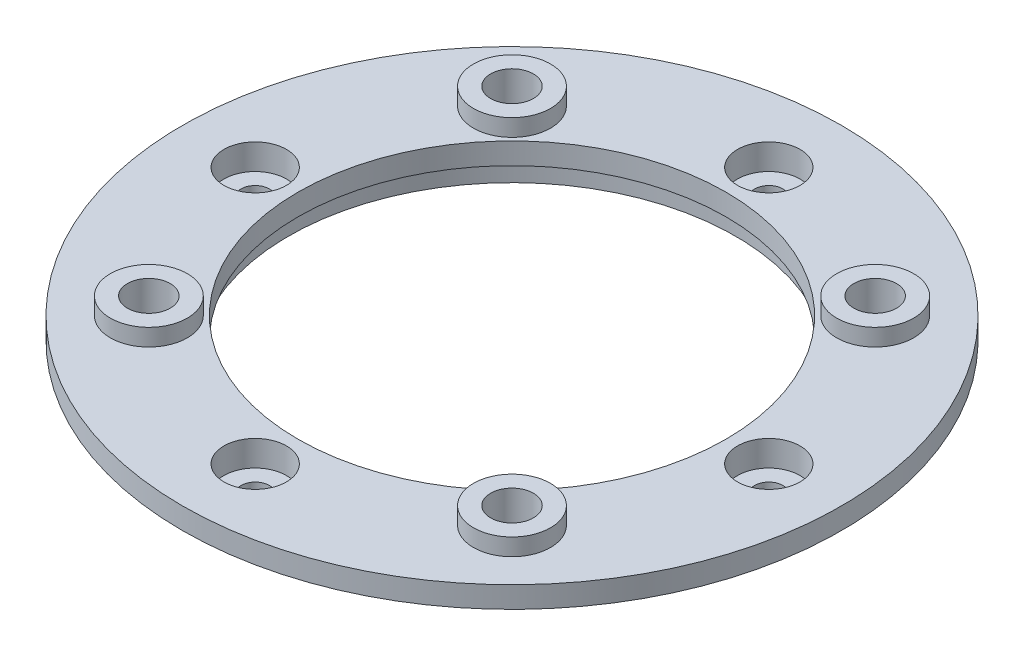
ISO-10303-21;
HEADER;
FILE_DESCRIPTION(('STEP AP214'),'2;1');
FILE_NAME('part.step','',(''),(''),'','','');
FILE_SCHEMA(('AUTOMOTIVE_DESIGN { 1 0 10303 214 1 1 1 1 }'));
ENDSEC;
DATA;
#1=APPLICATION_CONTEXT('core data for automotive mechanical design processes');
#2=APPLICATION_PROTOCOL_DEFINITION('international standard','automotive_design',2000,#1);
#3=PRODUCT_CONTEXT('',#1,'mechanical');
#4=PRODUCT('Part','Part','',(#3));
#5=PRODUCT_RELATED_PRODUCT_CATEGORY('part','',(#4));
#6=PRODUCT_DEFINITION_FORMATION('','',#4);
#7=PRODUCT_DEFINITION_CONTEXT('part definition',#1,'design');
#8=PRODUCT_DEFINITION('design','',#6,#7);
#9=PRODUCT_DEFINITION_SHAPE('','',#8);
#10=(LENGTH_UNIT() NAMED_UNIT(*) SI_UNIT(.MILLI.,.METRE.));
#11=(NAMED_UNIT(*) PLANE_ANGLE_UNIT() SI_UNIT($,.RADIAN.));
#12=(NAMED_UNIT(*) SI_UNIT($,.STERADIAN.) SOLID_ANGLE_UNIT());
#13=UNCERTAINTY_MEASURE_WITH_UNIT(LENGTH_MEASURE(1.E-05),#10,'distance_accuracy_value','');
#14=(GEOMETRIC_REPRESENTATION_CONTEXT(3) GLOBAL_UNCERTAINTY_ASSIGNED_CONTEXT((#13)) GLOBAL_UNIT_ASSIGNED_CONTEXT((#10,
#11,#12)) REPRESENTATION_CONTEXT('',''));
#15=CARTESIAN_POINT('',(0.,0.,0.));
#16=DIRECTION('',(0.,0.,1.));
#17=DIRECTION('',(1.,0.,0.));
#18=AXIS2_PLACEMENT_3D('',#15,#16,#17);
#19=CARTESIAN_POINT('',(0.,5.,0.));
#20=DIRECTION('',(0.,1.,0.));
#21=DIRECTION('',(0.,0.,1.));
#22=AXIS2_PLACEMENT_3D('',#19,#20,#21);
#23=PLANE('',#22);
#24=CARTESIAN_POINT('',(21.2132034355964,5.,21.2132034355965));
#25=DIRECTION('',(0.,1.,0.));
#26=DIRECTION('',(0.,0.,1.));
#27=AXIS2_PLACEMENT_3D('',#24,#25,#26);
#28=CIRCLE('',#27,4.5);
#29=CARTESIAN_POINT('',(21.2132034355964,5.,25.7132034355964));
#30=VERTEX_POINT('',#29);
#31=EDGE_CURVE('E161',#30,#30,#28,.T.);
#32=ORIENTED_EDGE('',*,*,#31,.F.);
#33=EDGE_LOOP('',(#32));
#34=FACE_BOUND('',#33,.T.);
#35=CARTESIAN_POINT('',(-21.2132034355964,5.,-21.2132034355965));
#36=DIRECTION('',(0.,1.,0.));
#37=DIRECTION('',(0.,0.,1.));
#38=AXIS2_PLACEMENT_3D('',#35,#36,#37);
#39=CIRCLE('',#38,4.5);
#40=CARTESIAN_POINT('',(-21.2132034355964,5.,-16.7132034355965));
#41=VERTEX_POINT('',#40);
#42=EDGE_CURVE('E141',#41,#41,#39,.T.);
#43=ORIENTED_EDGE('',*,*,#42,.F.);
#44=EDGE_LOOP('',(#43));
#45=FACE_BOUND('',#44,.T.);
#46=CARTESIAN_POINT('',(0.,5.,30.));
#47=DIRECTION('',(0.,1.,0.));
#48=DIRECTION('',(0.,0.,1.));
#49=AXIS2_PLACEMENT_3D('',#46,#47,#48);
#50=CIRCLE('',#49,3.65);
#51=CARTESIAN_POINT('',(0.,5.,33.65));
#52=VERTEX_POINT('',#51);
#53=EDGE_CURVE('E134',#52,#52,#50,.T.);
#54=ORIENTED_EDGE('',*,*,#53,.F.);
#55=EDGE_LOOP('',(#54));
#56=FACE_BOUND('',#55,.T.);
#57=CARTESIAN_POINT('',(30.,5.,0.));
#58=DIRECTION('',(0.,1.,0.));
#59=DIRECTION('',(0.,0.,1.));
#60=AXIS2_PLACEMENT_3D('',#57,#58,#59);
#61=CIRCLE('',#60,3.65);
#62=CARTESIAN_POINT('',(30.,5.,3.65));
#63=VERTEX_POINT('',#62);
#64=EDGE_CURVE('E129',#63,#63,#61,.T.);
#65=ORIENTED_EDGE('',*,*,#64,.F.);
#66=EDGE_LOOP('',(#65));
#67=FACE_BOUND('',#66,.T.);
#68=CARTESIAN_POINT('',(0.,5.,-30.));
#69=DIRECTION('',(0.,1.,0.));
#70=DIRECTION('',(0.,0.,1.));
#71=AXIS2_PLACEMENT_3D('',#68,#69,#70);
#72=CIRCLE('',#71,3.65);
#73=CARTESIAN_POINT('',(0.,5.,-26.35));
#74=VERTEX_POINT('',#73);
#75=EDGE_CURVE('E120',#74,#74,#72,.T.);
#76=ORIENTED_EDGE('',*,*,#75,.F.);
#77=EDGE_LOOP('',(#76));
#78=FACE_BOUND('',#77,.T.);
#79=CARTESIAN_POINT('',(-30.,5.,0.));
#80=DIRECTION('',(0.,1.,0.));
#81=DIRECTION('',(0.,0.,1.));
#82=AXIS2_PLACEMENT_3D('',#79,#80,#81);
#83=CIRCLE('',#82,3.65);
#84=CARTESIAN_POINT('',(-30.,5.,3.65000000000001));
#85=VERTEX_POINT('',#84);
#86=EDGE_CURVE('E109',#85,#85,#83,.T.);
#87=ORIENTED_EDGE('',*,*,#86,.F.);
#88=EDGE_LOOP('',(#87));
#89=FACE_BOUND('',#88,.T.);
#90=CARTESIAN_POINT('',(0.,5.,0.));
#91=DIRECTION('',(0.,1.,0.));
#92=DIRECTION('',(0.,0.,1.));
#93=AXIS2_PLACEMENT_3D('',#90,#91,#92);
#94=CIRCLE('',#93,38.5);
#95=CARTESIAN_POINT('',(0.,5.,38.5));
#96=VERTEX_POINT('',#95);
#97=EDGE_CURVE('E68',#96,#96,#94,.T.);
#98=ORIENTED_EDGE('',*,*,#97,.T.);
#99=EDGE_LOOP('',(#98));
#100=FACE_BOUND('',#99,.T.);
#101=CARTESIAN_POINT('',(0.,5.,0.));
#102=DIRECTION('',(0.,1.,0.));
#103=DIRECTION('',(0.,0.,1.));
#104=AXIS2_PLACEMENT_3D('',#101,#102,#103);
#105=CIRCLE('',#104,25.);
#106=CARTESIAN_POINT('',(0.,5.,25.));
#107=VERTEX_POINT('',#106);
#108=EDGE_CURVE('E72',#107,#107,#105,.T.);
#109=ORIENTED_EDGE('',*,*,#108,.F.);
#110=EDGE_LOOP('',(#109));
#111=FACE_BOUND('',#110,.T.);
#112=CARTESIAN_POINT('',(21.2132034355965,5.,-21.2132034355964));
#113=DIRECTION('',(0.,1.,0.));
#114=DIRECTION('',(0.,0.,1.));
#115=AXIS2_PLACEMENT_3D('',#112,#113,#114);
#116=CIRCLE('',#115,4.5);
#117=CARTESIAN_POINT('',(21.2132034355965,5.,-16.7132034355964));
#118=VERTEX_POINT('',#117);
#119=EDGE_CURVE('E152',#118,#118,#116,.T.);
#120=ORIENTED_EDGE('',*,*,#119,.F.);
#121=EDGE_LOOP('',(#120));
#122=FACE_BOUND('',#121,.T.);
#123=CARTESIAN_POINT('',(-21.2132034355965,5.,21.2132034355964));
#124=DIRECTION('',(0.,1.,0.));
#125=DIRECTION('',(0.,0.,1.));
#126=AXIS2_PLACEMENT_3D('',#123,#124,#125);
#127=CIRCLE('',#126,4.5);
#128=CARTESIAN_POINT('',(-21.2132034355965,5.,25.7132034355964));
#129=VERTEX_POINT('',#128);
#130=EDGE_CURVE('E170',#129,#129,#127,.T.);
#131=ORIENTED_EDGE('',*,*,#130,.F.);
#132=EDGE_LOOP('',(#131));
#133=FACE_BOUND('',#132,.T.);
#134=ADVANCED_FACE('F41',(#34,#45,#56,#67,#78,#89,#100,#111,#122,#133),#23,.T.);
#135=CARTESIAN_POINT('',(-30.,0.,0.));
#136=DIRECTION('',(0.,1.,0.));
#137=DIRECTION('',(0.,0.,1.));
#138=AXIS2_PLACEMENT_3D('',#135,#136,#137);
#139=CYLINDRICAL_SURFACE('',#138,1.65);
#140=CARTESIAN_POINT('',(-30.,0.,0.));
#141=DIRECTION('',(0.,1.,0.));
#142=DIRECTION('',(0.,0.,1.));
#143=AXIS2_PLACEMENT_3D('',#140,#141,#142);
#144=CIRCLE('',#143,1.65);
#145=CARTESIAN_POINT('',(-30.,0.,1.65));
#146=VERTEX_POINT('',#145);
#147=EDGE_CURVE('E84',#146,#146,#144,.T.);
#148=ORIENTED_EDGE('',*,*,#147,.F.);
#149=EDGE_LOOP('',(#148));
#150=FACE_BOUND('',#149,.T.);
#151=CARTESIAN_POINT('',(-30.,2.,0.));
#152=DIRECTION('',(0.,1.,0.));
#153=DIRECTION('',(0.,0.,1.));
#154=AXIS2_PLACEMENT_3D('',#151,#152,#153);
#155=CIRCLE('',#154,1.65);
#156=CARTESIAN_POINT('',(-30.,2.,1.65));
#157=VERTEX_POINT('',#156);
#158=EDGE_CURVE('E105',#157,#157,#155,.T.);
#159=ORIENTED_EDGE('',*,*,#158,.T.);
#160=EDGE_LOOP('',(#159));
#161=FACE_BOUND('',#160,.T.);
#162=ADVANCED_FACE('F180',(#150,#161),#139,.F.);
#163=CARTESIAN_POINT('',(0.,0.,30.));
#164=DIRECTION('',(0.,1.,0.));
#165=DIRECTION('',(0.,0.,1.));
#166=AXIS2_PLACEMENT_3D('',#163,#164,#165);
#167=CYLINDRICAL_SURFACE('',#166,1.65);
#168=CARTESIAN_POINT('',(0.,0.,30.));
#169=DIRECTION('',(0.,1.,0.));
#170=DIRECTION('',(0.,0.,1.));
#171=AXIS2_PLACEMENT_3D('',#168,#169,#170);
#172=CIRCLE('',#171,1.65);
#173=CARTESIAN_POINT('',(0.,0.,31.65));
#174=VERTEX_POINT('',#173);
#175=EDGE_CURVE('E91',#174,#174,#172,.T.);
#176=ORIENTED_EDGE('',*,*,#175,.F.);
#177=EDGE_LOOP('',(#176));
#178=FACE_BOUND('',#177,.T.);
#179=CARTESIAN_POINT('',(0.,2.,30.));
#180=DIRECTION('',(0.,1.,0.));
#181=DIRECTION('',(0.,0.,1.));
#182=AXIS2_PLACEMENT_3D('',#179,#180,#181);
#183=CIRCLE('',#182,1.65);
#184=CARTESIAN_POINT('',(0.,2.,31.65));
#185=VERTEX_POINT('',#184);
#186=EDGE_CURVE('E128',#185,#185,#183,.T.);
#187=ORIENTED_EDGE('',*,*,#186,.T.);
#188=EDGE_LOOP('',(#187));
#189=FACE_BOUND('',#188,.T.);
#190=ADVANCED_FACE('F188',(#178,#189),#167,.F.);
#191=CARTESIAN_POINT('',(30.,0.,0.));
#192=DIRECTION('',(0.,1.,0.));
#193=DIRECTION('',(0.,0.,1.));
#194=AXIS2_PLACEMENT_3D('',#191,#192,#193);
#195=CYLINDRICAL_SURFACE('',#194,1.65);
#196=CARTESIAN_POINT('',(30.,0.,0.));
#197=DIRECTION('',(0.,1.,0.));
#198=DIRECTION('',(0.,0.,1.));
#199=AXIS2_PLACEMENT_3D('',#196,#197,#198);
#200=CIRCLE('',#199,1.65);
#201=CARTESIAN_POINT('',(30.,0.,1.65));
#202=VERTEX_POINT('',#201);
#203=EDGE_CURVE('E97',#202,#202,#200,.T.);
#204=ORIENTED_EDGE('',*,*,#203,.F.);
#205=EDGE_LOOP('',(#204));
#206=FACE_BOUND('',#205,.T.);
#207=CARTESIAN_POINT('',(30.,2.,0.));
#208=DIRECTION('',(0.,1.,0.));
#209=DIRECTION('',(0.,0.,1.));
#210=AXIS2_PLACEMENT_3D('',#207,#208,#209);
#211=CIRCLE('',#210,1.65);
#212=CARTESIAN_POINT('',(30.,2.,1.65));
#213=VERTEX_POINT('',#212);
#214=EDGE_CURVE('E125',#213,#213,#211,.T.);
#215=ORIENTED_EDGE('',*,*,#214,.T.);
#216=EDGE_LOOP('',(#215));
#217=FACE_BOUND('',#216,.T.);
#218=ADVANCED_FACE('F224',(#206,#217),#195,.F.);
#219=CARTESIAN_POINT('',(0.,0.,-30.));
#220=DIRECTION('',(0.,1.,0.));
#221=DIRECTION('',(0.,0.,1.));
#222=AXIS2_PLACEMENT_3D('',#219,#220,#221);
#223=CYLINDRICAL_SURFACE('',#222,1.65);
#224=CARTESIAN_POINT('',(0.,0.,-30.));
#225=DIRECTION('',(0.,1.,0.));
#226=DIRECTION('',(0.,0.,1.));
#227=AXIS2_PLACEMENT_3D('',#224,#225,#226);
#228=CIRCLE('',#227,1.65);
#229=CARTESIAN_POINT('',(0.,0.,-28.35));
#230=VERTEX_POINT('',#229);
#231=EDGE_CURVE('E78',#230,#230,#228,.T.);
#232=ORIENTED_EDGE('',*,*,#231,.F.);
#233=EDGE_LOOP('',(#232));
#234=FACE_BOUND('',#233,.T.);
#235=CARTESIAN_POINT('',(0.,2.,-30.));
#236=DIRECTION('',(0.,1.,0.));
#237=DIRECTION('',(0.,0.,1.));
#238=AXIS2_PLACEMENT_3D('',#235,#236,#237);
#239=CIRCLE('',#238,1.65);
#240=CARTESIAN_POINT('',(0.,2.,-28.35));
#241=VERTEX_POINT('',#240);
#242=EDGE_CURVE('E116',#241,#241,#239,.T.);
#243=ORIENTED_EDGE('',*,*,#242,.T.);
#244=EDGE_LOOP('',(#243));
#245=FACE_BOUND('',#244,.T.);
#246=ADVANCED_FACE('F218',(#234,#245),#223,.F.);
#247=CARTESIAN_POINT('',(0.,0.,0.));
#248=DIRECTION('',(0.,1.,0.));
#249=DIRECTION('',(0.,0.,1.));
#250=AXIS2_PLACEMENT_3D('',#247,#248,#249);
#251=PLANE('',#250);
#252=ORIENTED_EDGE('',*,*,#231,.T.);
#253=EDGE_LOOP('',(#252));
#254=FACE_BOUND('',#253,.T.);
#255=CARTESIAN_POINT('',(21.2132034355965,0.,-21.2132034355964));
#256=DIRECTION('',(0.,1.,0.));
#257=DIRECTION('',(0.,0.,1.));
#258=AXIS2_PLACEMENT_3D('',#255,#256,#257);
#259=CIRCLE('',#258,2.5);
#260=CARTESIAN_POINT('',(21.2132034355965,0.,-18.7132034355964));
#261=VERTEX_POINT('',#260);
#262=EDGE_CURVE('E100',#261,#261,#259,.T.);
#263=ORIENTED_EDGE('',*,*,#262,.T.);
#264=EDGE_LOOP('',(#263));
#265=FACE_BOUND('',#264,.T.);
#266=ORIENTED_EDGE('',*,*,#203,.T.);
#267=EDGE_LOOP('',(#266));
#268=FACE_BOUND('',#267,.T.);
#269=CARTESIAN_POINT('',(21.2132034355964,0.,21.2132034355965));
#270=DIRECTION('',(0.,1.,0.));
#271=DIRECTION('',(0.,0.,1.));
#272=AXIS2_PLACEMENT_3D('',#269,#270,#271);
#273=CIRCLE('',#272,2.5);
#274=CARTESIAN_POINT('',(21.2132034355964,0.,23.7132034355965));
#275=VERTEX_POINT('',#274);
#276=EDGE_CURVE('E94',#275,#275,#273,.T.);
#277=ORIENTED_EDGE('',*,*,#276,.T.);
#278=EDGE_LOOP('',(#277));
#279=FACE_BOUND('',#278,.T.);
#280=ORIENTED_EDGE('',*,*,#175,.T.);
#281=EDGE_LOOP('',(#280));
#282=FACE_BOUND('',#281,.T.);
#283=CARTESIAN_POINT('',(-21.2132034355965,0.,21.2132034355964));
#284=DIRECTION('',(0.,1.,0.));
#285=DIRECTION('',(0.,0.,1.));
#286=AXIS2_PLACEMENT_3D('',#283,#284,#285);
#287=CIRCLE('',#286,2.5);
#288=CARTESIAN_POINT('',(-21.2132034355965,0.,23.7132034355964));
#289=VERTEX_POINT('',#288);
#290=EDGE_CURVE('E88',#289,#289,#287,.T.);
#291=ORIENTED_EDGE('',*,*,#290,.T.);
#292=EDGE_LOOP('',(#291));
#293=FACE_BOUND('',#292,.T.);
#294=ORIENTED_EDGE('',*,*,#147,.T.);
#295=EDGE_LOOP('',(#294));
#296=FACE_BOUND('',#295,.T.);
#297=CARTESIAN_POINT('',(-21.2132034355964,0.,-21.2132034355965));
#298=DIRECTION('',(0.,1.,0.));
#299=DIRECTION('',(0.,0.,1.));
#300=AXIS2_PLACEMENT_3D('',#297,#298,#299);
#301=CIRCLE('',#300,2.5);
#302=CARTESIAN_POINT('',(-21.2132034355964,0.,-18.7132034355965));
#303=VERTEX_POINT('',#302);
#304=EDGE_CURVE('E81',#303,#303,#301,.T.);
#305=ORIENTED_EDGE('',*,*,#304,.T.);
#306=EDGE_LOOP('',(#305));
#307=FACE_BOUND('',#306,.T.);
#308=CARTESIAN_POINT('',(0.,0.,0.));
#309=DIRECTION('',(0.,1.,0.));
#310=DIRECTION('',(0.,0.,1.));
#311=AXIS2_PLACEMENT_3D('',#308,#309,#310);
#312=CIRCLE('',#311,34.);
#313=CARTESIAN_POINT('',(0.,0.,34.));
#314=VERTEX_POINT('',#313);
#315=EDGE_CURVE('E49',#314,#314,#312,.T.);
#316=ORIENTED_EDGE('',*,*,#315,.F.);
#317=EDGE_LOOP('',(#316));
#318=FACE_BOUND('',#317,.T.);
#319=CARTESIAN_POINT('',(0.,0.,0.));
#320=DIRECTION('',(0.,1.,0.));
#321=DIRECTION('',(0.,0.,1.));
#322=AXIS2_PLACEMENT_3D('',#319,#320,#321);
#323=CIRCLE('',#322,26.1);
#324=CARTESIAN_POINT('',(0.,0.,26.1));
#325=VERTEX_POINT('',#324);
#326=EDGE_CURVE('E53',#325,#325,#323,.T.);
#327=ORIENTED_EDGE('',*,*,#326,.T.);
#328=EDGE_LOOP('',(#327));
#329=FACE_BOUND('',#328,.T.);
#330=ADVANCED_FACE('F215',(#254,#265,#268,#279,#282,#293,#296,#307,#318,#329),#251,.F.);
#331=CARTESIAN_POINT('',(0.,0.5,0.));
#332=DIRECTION('',(0.,-1.,0.));
#333=DIRECTION('',(0.,0.,-1.));
#334=AXIS2_PLACEMENT_3D('',#331,#332,#333);
#335=CYLINDRICAL_SURFACE('',#334,26.1);
#336=ORIENTED_EDGE('',*,*,#326,.F.);
#337=EDGE_LOOP('',(#336));
#338=FACE_BOUND('',#337,.T.);
#339=CARTESIAN_POINT('',(0.,2.5,0.));
#340=DIRECTION('',(0.,1.,0.));
#341=DIRECTION('',(0.,0.,1.));
#342=AXIS2_PLACEMENT_3D('',#339,#340,#341);
#343=CIRCLE('',#342,26.1);
#344=CARTESIAN_POINT('',(0.,2.5,26.1));
#345=VERTEX_POINT('',#344);
#346=EDGE_CURVE('E63',#345,#345,#343,.T.);
#347=ORIENTED_EDGE('',*,*,#346,.T.);
#348=EDGE_LOOP('',(#347));
#349=FACE_BOUND('',#348,.T.);
#350=ADVANCED_FACE('F210',(#338,#349),#335,.F.);
#351=CARTESIAN_POINT('',(0.,0.5,0.));
#352=DIRECTION('',(0.,1.,0.));
#353=DIRECTION('',(0.,0.,1.));
#354=AXIS2_PLACEMENT_3D('',#351,#352,#353);
#355=PLANE('',#354);
#356=CARTESIAN_POINT('',(0.,0.5,0.));
#357=DIRECTION('',(0.,1.,0.));
#358=DIRECTION('',(0.,0.,1.));
#359=AXIS2_PLACEMENT_3D('',#356,#357,#358);
#360=CIRCLE('',#359,34.5);
#361=CARTESIAN_POINT('',(0.,0.5,34.5));
#362=VERTEX_POINT('',#361);
#363=EDGE_CURVE('E10',#362,#362,#360,.T.);
#364=ORIENTED_EDGE('',*,*,#363,.T.);
#365=EDGE_LOOP('',(#364));
#366=FACE_BOUND('',#365,.T.);
#367=CARTESIAN_POINT('',(0.,0.5,0.));
#368=DIRECTION('',(0.,1.,0.));
#369=DIRECTION('',(0.,0.,1.));
#370=AXIS2_PLACEMENT_3D('',#367,#368,#369);
#371=CIRCLE('',#370,35.5);
#372=CARTESIAN_POINT('',(0.,0.5,35.5));
#373=VERTEX_POINT('',#372);
#374=EDGE_CURVE('E60',#373,#373,#371,.T.);
#375=ORIENTED_EDGE('',*,*,#374,.F.);
#376=EDGE_LOOP('',(#375));
#377=FACE_BOUND('',#376,.T.);
#378=ADVANCED_FACE('F206',(#366,#377),#355,.F.);
#379=CARTESIAN_POINT('',(0.,2.5,0.));
#380=DIRECTION('',(0.,-1.,0.));
#381=DIRECTION('',(0.,0.,-1.));
#382=AXIS2_PLACEMENT_3D('',#379,#380,#381);
#383=CYLINDRICAL_SURFACE('',#382,35.5);
#384=CARTESIAN_POINT('',(0.,2.5,0.));
#385=DIRECTION('',(0.,1.,0.));
#386=DIRECTION('',(0.,0.,1.));
#387=AXIS2_PLACEMENT_3D('',#384,#385,#386);
#388=CIRCLE('',#387,35.5);
#389=CARTESIAN_POINT('',(0.,2.5,35.5));
#390=VERTEX_POINT('',#389);
#391=EDGE_CURVE('E57',#390,#390,#388,.T.);
#392=ORIENTED_EDGE('',*,*,#391,.F.);
#393=EDGE_LOOP('',(#392));
#394=FACE_BOUND('',#393,.T.);
#395=ORIENTED_EDGE('',*,*,#374,.T.);
#396=EDGE_LOOP('',(#395));
#397=FACE_BOUND('',#396,.T.);
#398=ADVANCED_FACE('F209',(#394,#397),#383,.T.);
#399=CARTESIAN_POINT('',(0.,2.5,0.));
#400=DIRECTION('',(0.,1.,0.));
#401=DIRECTION('',(0.,0.,1.));
#402=AXIS2_PLACEMENT_3D('',#399,#400,#401);
#403=PLANE('',#402);
#404=CARTESIAN_POINT('',(0.,2.5,0.));
#405=DIRECTION('',(0.,1.,0.));
#406=DIRECTION('',(0.,0.,1.));
#407=AXIS2_PLACEMENT_3D('',#404,#405,#406);
#408=CIRCLE('',#407,25.);
#409=CARTESIAN_POINT('',(0.,2.5,25.));
#410=VERTEX_POINT('',#409);
#411=EDGE_CURVE('E75',#410,#410,#408,.T.);
#412=ORIENTED_EDGE('',*,*,#411,.T.);
#413=EDGE_LOOP('',(#412));
#414=FACE_BOUND('',#413,.T.);
#415=ORIENTED_EDGE('',*,*,#346,.F.);
#416=EDGE_LOOP('',(#415));
#417=FACE_BOUND('',#416,.T.);
#418=ADVANCED_FACE('F201',(#414,#417),#403,.F.);
#419=ORIENTED_EDGE('',*,*,#391,.T.);
#420=EDGE_LOOP('',(#419));
#421=FACE_BOUND('',#420,.T.);
#422=CARTESIAN_POINT('',(0.,2.5,0.));
#423=DIRECTION('',(0.,1.,0.));
#424=DIRECTION('',(0.,0.,1.));
#425=AXIS2_PLACEMENT_3D('',#422,#423,#424);
#426=CIRCLE('',#425,38.5);
#427=CARTESIAN_POINT('',(0.,2.5,38.5));
#428=VERTEX_POINT('',#427);
#429=EDGE_CURVE('E69',#428,#428,#426,.T.);
#430=ORIENTED_EDGE('',*,*,#429,.F.);
#431=EDGE_LOOP('',(#430));
#432=FACE_BOUND('',#431,.T.);
#433=ADVANCED_FACE('F197',(#421,#432),#403,.F.);
#434=CARTESIAN_POINT('',(0.,5.,0.));
#435=DIRECTION('',(0.,-1.,0.));
#436=DIRECTION('',(0.,0.,-1.));
#437=AXIS2_PLACEMENT_3D('',#434,#435,#436);
#438=CYLINDRICAL_SURFACE('',#437,38.5);
#439=ORIENTED_EDGE('',*,*,#97,.F.);
#440=EDGE_LOOP('',(#439));
#441=FACE_BOUND('',#440,.T.);
#442=ORIENTED_EDGE('',*,*,#429,.T.);
#443=EDGE_LOOP('',(#442));
#444=FACE_BOUND('',#443,.T.);
#445=ADVANCED_FACE('F200',(#441,#444),#438,.T.);
#446=CARTESIAN_POINT('',(0.,5.,0.));
#447=DIRECTION('',(0.,-1.,0.));
#448=DIRECTION('',(0.,0.,-1.));
#449=AXIS2_PLACEMENT_3D('',#446,#447,#448);
#450=CYLINDRICAL_SURFACE('',#449,25.);
#451=ORIENTED_EDGE('',*,*,#108,.T.);
#452=EDGE_LOOP('',(#451));
#453=FACE_BOUND('',#452,.T.);
#454=ORIENTED_EDGE('',*,*,#411,.F.);
#455=EDGE_LOOP('',(#454));
#456=FACE_BOUND('',#455,.T.);
#457=ADVANCED_FACE('F195',(#453,#456),#450,.F.);
#458=CARTESIAN_POINT('',(0.,0.5,0.));
#459=DIRECTION('',(0.,1.,0.));
#460=DIRECTION('',(0.,0.,1.));
#461=AXIS2_PLACEMENT_3D('',#458,#459,#460);
#462=CONICAL_SURFACE('',#461,34.5,0.785398163397441);
#463=ORIENTED_EDGE('',*,*,#315,.T.);
#464=EDGE_LOOP('',(#463));
#465=FACE_BOUND('',#464,.T.);
#466=ORIENTED_EDGE('',*,*,#363,.F.);
#467=EDGE_LOOP('',(#466));
#468=FACE_BOUND('',#467,.T.);
#469=ADVANCED_FACE('F44',(#465,#468),#462,.T.);
#470=CARTESIAN_POINT('',(-21.2132034355964,0.,-21.2132034355965));
#471=DIRECTION('',(0.,1.,0.));
#472=DIRECTION('',(0.,0.,1.));
#473=AXIS2_PLACEMENT_3D('',#470,#471,#472);
#474=CYLINDRICAL_SURFACE('',#473,2.5);
#475=ORIENTED_EDGE('',*,*,#304,.F.);
#476=EDGE_LOOP('',(#475));
#477=FACE_BOUND('',#476,.T.);
#478=CARTESIAN_POINT('',(-21.2132034355964,7.,-21.2132034355965));
#479=DIRECTION('',(0.,1.,0.));
#480=DIRECTION('',(0.,0.,1.));
#481=AXIS2_PLACEMENT_3D('',#478,#479,#480);
#482=CIRCLE('',#481,2.5);
#483=CARTESIAN_POINT('',(-21.2132034355964,7.,-18.7132034355965));
#484=VERTEX_POINT('',#483);
#485=EDGE_CURVE('E144',#484,#484,#482,.T.);
#486=ORIENTED_EDGE('',*,*,#485,.T.);
#487=EDGE_LOOP('',(#486));
#488=FACE_BOUND('',#487,.T.);
#489=ADVANCED_FACE('F258',(#477,#488),#474,.F.);
#490=CARTESIAN_POINT('',(-21.2132034355965,0.,21.2132034355964));
#491=DIRECTION('',(0.,1.,0.));
#492=DIRECTION('',(0.,0.,1.));
#493=AXIS2_PLACEMENT_3D('',#490,#491,#492);
#494=CYLINDRICAL_SURFACE('',#493,2.5);
#495=ORIENTED_EDGE('',*,*,#290,.F.);
#496=EDGE_LOOP('',(#495));
#497=FACE_BOUND('',#496,.T.);
#498=CARTESIAN_POINT('',(-21.2132034355965,7.,21.2132034355964));
#499=DIRECTION('',(0.,1.,0.));
#500=DIRECTION('',(0.,0.,1.));
#501=AXIS2_PLACEMENT_3D('',#498,#499,#500);
#502=CIRCLE('',#501,2.5);
#503=CARTESIAN_POINT('',(-21.2132034355965,7.,23.7132034355964));
#504=VERTEX_POINT('',#503);
#505=EDGE_CURVE('E165',#504,#504,#502,.T.);
#506=ORIENTED_EDGE('',*,*,#505,.T.);
#507=EDGE_LOOP('',(#506));
#508=FACE_BOUND('',#507,.T.);
#509=ADVANCED_FACE('F331',(#497,#508),#494,.F.);
#510=CARTESIAN_POINT('',(21.2132034355964,0.,21.2132034355965));
#511=DIRECTION('',(0.,1.,0.));
#512=DIRECTION('',(0.,0.,1.));
#513=AXIS2_PLACEMENT_3D('',#510,#511,#512);
#514=CYLINDRICAL_SURFACE('',#513,2.5);
#515=ORIENTED_EDGE('',*,*,#276,.F.);
#516=EDGE_LOOP('',(#515));
#517=FACE_BOUND('',#516,.T.);
#518=CARTESIAN_POINT('',(21.2132034355964,7.,21.2132034355965));
#519=DIRECTION('',(0.,1.,0.));
#520=DIRECTION('',(0.,0.,1.));
#521=AXIS2_PLACEMENT_3D('',#518,#519,#520);
#522=CIRCLE('',#521,2.49999999999999);
#523=CARTESIAN_POINT('',(21.2132034355964,7.,23.7132034355964));
#524=VERTEX_POINT('',#523);
#525=EDGE_CURVE('E156',#524,#524,#522,.T.);
#526=ORIENTED_EDGE('',*,*,#525,.T.);
#527=EDGE_LOOP('',(#526));
#528=FACE_BOUND('',#527,.T.);
#529=ADVANCED_FACE('F324',(#517,#528),#514,.F.);
#530=CARTESIAN_POINT('',(21.2132034355965,0.,-21.2132034355964));
#531=DIRECTION('',(0.,1.,0.));
#532=DIRECTION('',(0.,0.,1.));
#533=AXIS2_PLACEMENT_3D('',#530,#531,#532);
#534=CYLINDRICAL_SURFACE('',#533,2.5);
#535=ORIENTED_EDGE('',*,*,#262,.F.);
#536=EDGE_LOOP('',(#535));
#537=FACE_BOUND('',#536,.T.);
#538=CARTESIAN_POINT('',(21.2132034355965,7.,-21.2132034355964));
#539=DIRECTION('',(0.,1.,0.));
#540=DIRECTION('',(0.,0.,1.));
#541=AXIS2_PLACEMENT_3D('',#538,#539,#540);
#542=CIRCLE('',#541,2.5);
#543=CARTESIAN_POINT('',(21.2132034355965,7.,-18.7132034355964));
#544=VERTEX_POINT('',#543);
#545=EDGE_CURVE('E149',#544,#544,#542,.T.);
#546=ORIENTED_EDGE('',*,*,#545,.T.);
#547=EDGE_LOOP('',(#546));
#548=FACE_BOUND('',#547,.T.);
#549=ADVANCED_FACE('F312',(#537,#548),#534,.F.);
#550=CARTESIAN_POINT('',(0.,2.,-30.));
#551=DIRECTION('',(0.,1.,0.));
#552=DIRECTION('',(0.,0.,1.));
#553=AXIS2_PLACEMENT_3D('',#550,#551,#552);
#554=CYLINDRICAL_SURFACE('',#553,3.65);
#555=CARTESIAN_POINT('',(0.,2.,-30.));
#556=DIRECTION('',(0.,1.,0.));
#557=DIRECTION('',(0.,0.,1.));
#558=AXIS2_PLACEMENT_3D('',#555,#556,#557);
#559=CIRCLE('',#558,3.65);
#560=CARTESIAN_POINT('',(0.,2.,-26.35));
#561=VERTEX_POINT('',#560);
#562=EDGE_CURVE('E108',#561,#561,#559,.T.);
#563=ORIENTED_EDGE('',*,*,#562,.F.);
#564=EDGE_LOOP('',(#563));
#565=FACE_BOUND('',#564,.T.);
#566=ORIENTED_EDGE('',*,*,#75,.T.);
#567=EDGE_LOOP('',(#566));
#568=FACE_BOUND('',#567,.T.);
#569=ADVANCED_FACE('F309',(#565,#568),#554,.F.);
#570=CARTESIAN_POINT('',(0.,2.,-30.));
#571=DIRECTION('',(0.,1.,0.));
#572=DIRECTION('',(0.,0.,1.));
#573=AXIS2_PLACEMENT_3D('',#570,#571,#572);
#574=PLANE('',#573);
#575=ORIENTED_EDGE('',*,*,#242,.F.);
#576=EDGE_LOOP('',(#575));
#577=FACE_BOUND('',#576,.T.);
#578=ORIENTED_EDGE('',*,*,#562,.T.);
#579=EDGE_LOOP('',(#578));
#580=FACE_BOUND('',#579,.T.);
#581=ADVANCED_FACE('F304',(#577,#580),#574,.T.);
#582=CARTESIAN_POINT('',(30.,2.,0.));
#583=DIRECTION('',(0.,1.,0.));
#584=DIRECTION('',(0.,0.,1.));
#585=AXIS2_PLACEMENT_3D('',#582,#583,#584);
#586=CYLINDRICAL_SURFACE('',#585,3.65);
#587=CARTESIAN_POINT('',(30.,2.,0.));
#588=DIRECTION('',(0.,1.,0.));
#589=DIRECTION('',(0.,0.,1.));
#590=AXIS2_PLACEMENT_3D('',#587,#588,#589);
#591=CIRCLE('',#590,3.65);
#592=CARTESIAN_POINT('',(30.,2.,3.65));
#593=VERTEX_POINT('',#592);
#594=EDGE_CURVE('E119',#593,#593,#591,.T.);
#595=ORIENTED_EDGE('',*,*,#594,.F.);
#596=EDGE_LOOP('',(#595));
#597=FACE_BOUND('',#596,.T.);
#598=ORIENTED_EDGE('',*,*,#64,.T.);
#599=EDGE_LOOP('',(#598));
#600=FACE_BOUND('',#599,.T.);
#601=ADVANCED_FACE('F301',(#597,#600),#586,.F.);
#602=CARTESIAN_POINT('',(30.,2.,0.));
#603=DIRECTION('',(0.,1.,0.));
#604=DIRECTION('',(0.,0.,1.));
#605=AXIS2_PLACEMENT_3D('',#602,#603,#604);
#606=PLANE('',#605);
#607=ORIENTED_EDGE('',*,*,#214,.F.);
#608=EDGE_LOOP('',(#607));
#609=FACE_BOUND('',#608,.T.);
#610=ORIENTED_EDGE('',*,*,#594,.T.);
#611=EDGE_LOOP('',(#610));
#612=FACE_BOUND('',#611,.T.);
#613=ADVANCED_FACE('F299',(#609,#612),#606,.T.);
#614=CARTESIAN_POINT('',(0.,2.,30.));
#615=DIRECTION('',(0.,1.,0.));
#616=DIRECTION('',(0.,0.,1.));
#617=AXIS2_PLACEMENT_3D('',#614,#615,#616);
#618=CYLINDRICAL_SURFACE('',#617,3.65);
#619=CARTESIAN_POINT('',(0.,2.,30.));
#620=DIRECTION('',(0.,1.,0.));
#621=DIRECTION('',(0.,0.,1.));
#622=AXIS2_PLACEMENT_3D('',#619,#620,#621);
#623=CIRCLE('',#622,3.65);
#624=CARTESIAN_POINT('',(0.,2.,33.65));
#625=VERTEX_POINT('',#624);
#626=EDGE_CURVE('E85',#625,#625,#623,.T.);
#627=ORIENTED_EDGE('',*,*,#626,.F.);
#628=EDGE_LOOP('',(#627));
#629=FACE_BOUND('',#628,.T.);
#630=ORIENTED_EDGE('',*,*,#53,.T.);
#631=EDGE_LOOP('',(#630));
#632=FACE_BOUND('',#631,.T.);
#633=ADVANCED_FACE('F295',(#629,#632),#618,.F.);
#634=CARTESIAN_POINT('',(0.,2.,30.));
#635=DIRECTION('',(0.,1.,0.));
#636=DIRECTION('',(0.,0.,1.));
#637=AXIS2_PLACEMENT_3D('',#634,#635,#636);
#638=PLANE('',#637);
#639=ORIENTED_EDGE('',*,*,#186,.F.);
#640=EDGE_LOOP('',(#639));
#641=FACE_BOUND('',#640,.T.);
#642=ORIENTED_EDGE('',*,*,#626,.T.);
#643=EDGE_LOOP('',(#642));
#644=FACE_BOUND('',#643,.T.);
#645=ADVANCED_FACE('F291',(#641,#644),#638,.T.);
#646=CARTESIAN_POINT('',(-30.,2.,0.));
#647=DIRECTION('',(0.,1.,0.));
#648=DIRECTION('',(0.,0.,1.));
#649=AXIS2_PLACEMENT_3D('',#646,#647,#648);
#650=CYLINDRICAL_SURFACE('',#649,3.65);
#651=CARTESIAN_POINT('',(-30.,2.,0.));
#652=DIRECTION('',(0.,1.,0.));
#653=DIRECTION('',(0.,0.,1.));
#654=AXIS2_PLACEMENT_3D('',#651,#652,#653);
#655=CIRCLE('',#654,3.65);
#656=CARTESIAN_POINT('',(-30.,2.,3.65000000000001));
#657=VERTEX_POINT('',#656);
#658=EDGE_CURVE('E110',#657,#657,#655,.T.);
#659=ORIENTED_EDGE('',*,*,#658,.F.);
#660=EDGE_LOOP('',(#659));
#661=FACE_BOUND('',#660,.T.);
#662=ORIENTED_EDGE('',*,*,#86,.T.);
#663=EDGE_LOOP('',(#662));
#664=FACE_BOUND('',#663,.T.);
#665=ADVANCED_FACE('F294',(#661,#664),#650,.F.);
#666=CARTESIAN_POINT('',(-30.,2.,0.));
#667=DIRECTION('',(0.,1.,0.));
#668=DIRECTION('',(0.,0.,1.));
#669=AXIS2_PLACEMENT_3D('',#666,#667,#668);
#670=PLANE('',#669);
#671=ORIENTED_EDGE('',*,*,#158,.F.);
#672=EDGE_LOOP('',(#671));
#673=FACE_BOUND('',#672,.T.);
#674=ORIENTED_EDGE('',*,*,#658,.T.);
#675=EDGE_LOOP('',(#674));
#676=FACE_BOUND('',#675,.T.);
#677=ADVANCED_FACE('F286',(#673,#676),#670,.T.);
#678=CARTESIAN_POINT('',(-21.2132034355964,7.,-21.2132034355965));
#679=DIRECTION('',(0.,1.,0.));
#680=DIRECTION('',(0.,0.,1.));
#681=AXIS2_PLACEMENT_3D('',#678,#679,#680);
#682=PLANE('',#681);
#683=CARTESIAN_POINT('',(-21.2132034355964,7.,-21.2132034355965));
#684=DIRECTION('',(0.,1.,0.));
#685=DIRECTION('',(0.,0.,1.));
#686=AXIS2_PLACEMENT_3D('',#683,#684,#685);
#687=CIRCLE('',#686,4.5);
#688=CARTESIAN_POINT('',(-21.2132034355964,7.,-16.7132034355965));
#689=VERTEX_POINT('',#688);
#690=EDGE_CURVE('E113',#689,#689,#687,.T.);
#691=ORIENTED_EDGE('',*,*,#690,.T.);
#692=EDGE_LOOP('',(#691));
#693=FACE_BOUND('',#692,.T.);
#694=ORIENTED_EDGE('',*,*,#485,.F.);
#695=EDGE_LOOP('',(#694));
#696=FACE_BOUND('',#695,.T.);
#697=ADVANCED_FACE('F283',(#693,#696),#682,.T.);
#698=CARTESIAN_POINT('',(-21.2132034355964,7.,-21.2132034355965));
#699=DIRECTION('',(0.,-1.,0.));
#700=DIRECTION('',(0.,0.,-1.));
#701=AXIS2_PLACEMENT_3D('',#698,#699,#700);
#702=CYLINDRICAL_SURFACE('',#701,4.5);
#703=ORIENTED_EDGE('',*,*,#690,.F.);
#704=EDGE_LOOP('',(#703));
#705=FACE_BOUND('',#704,.T.);
#706=ORIENTED_EDGE('',*,*,#42,.T.);
#707=EDGE_LOOP('',(#706));
#708=FACE_BOUND('',#707,.T.);
#709=ADVANCED_FACE('F277',(#705,#708),#702,.T.);
#710=CARTESIAN_POINT('',(21.2132034355965,7.,-21.2132034355964));
#711=DIRECTION('',(0.,1.,0.));
#712=DIRECTION('',(0.,0.,1.));
#713=AXIS2_PLACEMENT_3D('',#710,#711,#712);
#714=PLANE('',#713);
#715=CARTESIAN_POINT('',(21.2132034355965,7.,-21.2132034355964));
#716=DIRECTION('',(0.,1.,0.));
#717=DIRECTION('',(0.,0.,1.));
#718=AXIS2_PLACEMENT_3D('',#715,#716,#717);
#719=CIRCLE('',#718,4.5);
#720=CARTESIAN_POINT('',(21.2132034355965,7.,-16.7132034355964));
#721=VERTEX_POINT('',#720);
#722=EDGE_CURVE('E153',#721,#721,#719,.T.);
#723=ORIENTED_EDGE('',*,*,#722,.T.);
#724=EDGE_LOOP('',(#723));
#725=FACE_BOUND('',#724,.T.);
#726=ORIENTED_EDGE('',*,*,#545,.F.);
#727=EDGE_LOOP('',(#726));
#728=FACE_BOUND('',#727,.T.);
#729=ADVANCED_FACE('F267',(#725,#728),#714,.T.);
#730=CARTESIAN_POINT('',(21.2132034355965,7.,-21.2132034355964));
#731=DIRECTION('',(0.,-1.,0.));
#732=DIRECTION('',(0.,0.,-1.));
#733=AXIS2_PLACEMENT_3D('',#730,#731,#732);
#734=CYLINDRICAL_SURFACE('',#733,4.5);
#735=ORIENTED_EDGE('',*,*,#722,.F.);
#736=EDGE_LOOP('',(#735));
#737=FACE_BOUND('',#736,.T.);
#738=ORIENTED_EDGE('',*,*,#119,.T.);
#739=EDGE_LOOP('',(#738));
#740=FACE_BOUND('',#739,.T.);
#741=ADVANCED_FACE('F264',(#737,#740),#734,.T.);
#742=CARTESIAN_POINT('',(21.2132034355964,7.,21.2132034355965));
#743=DIRECTION('',(0.,1.,0.));
#744=DIRECTION('',(0.,0.,1.));
#745=AXIS2_PLACEMENT_3D('',#742,#743,#744);
#746=PLANE('',#745);
#747=CARTESIAN_POINT('',(21.2132034355964,7.,21.2132034355965));
#748=DIRECTION('',(0.,1.,0.));
#749=DIRECTION('',(0.,0.,1.));
#750=AXIS2_PLACEMENT_3D('',#747,#748,#749);
#751=CIRCLE('',#750,4.5);
#752=CARTESIAN_POINT('',(21.2132034355964,7.,25.7132034355964));
#753=VERTEX_POINT('',#752);
#754=EDGE_CURVE('E162',#753,#753,#751,.T.);
#755=ORIENTED_EDGE('',*,*,#754,.T.);
#756=EDGE_LOOP('',(#755));
#757=FACE_BOUND('',#756,.T.);
#758=ORIENTED_EDGE('',*,*,#525,.F.);
#759=EDGE_LOOP('',(#758));
#760=FACE_BOUND('',#759,.T.);
#761=ADVANCED_FACE('F266',(#757,#760),#746,.T.);
#762=CARTESIAN_POINT('',(21.2132034355964,7.,21.2132034355965));
#763=DIRECTION('',(0.,-1.,0.));
#764=DIRECTION('',(0.,0.,-1.));
#765=AXIS2_PLACEMENT_3D('',#762,#763,#764);
#766=CYLINDRICAL_SURFACE('',#765,4.5);
#767=ORIENTED_EDGE('',*,*,#754,.F.);
#768=EDGE_LOOP('',(#767));
#769=FACE_BOUND('',#768,.T.);
#770=ORIENTED_EDGE('',*,*,#31,.T.);
#771=EDGE_LOOP('',(#770));
#772=FACE_BOUND('',#771,.T.);
#773=ADVANCED_FACE('F274',(#769,#772),#766,.T.);
#774=CARTESIAN_POINT('',(-21.2132034355965,7.,21.2132034355964));
#775=DIRECTION('',(0.,1.,0.));
#776=DIRECTION('',(0.,0.,1.));
#777=AXIS2_PLACEMENT_3D('',#774,#775,#776);
#778=PLANE('',#777);
#779=CARTESIAN_POINT('',(-21.2132034355965,7.,21.2132034355964));
#780=DIRECTION('',(0.,1.,0.));
#781=DIRECTION('',(0.,0.,1.));
#782=AXIS2_PLACEMENT_3D('',#779,#780,#781);
#783=CIRCLE('',#782,4.5);
#784=CARTESIAN_POINT('',(-21.2132034355965,7.,25.7132034355964));
#785=VERTEX_POINT('',#784);
#786=EDGE_CURVE('E171',#785,#785,#783,.T.);
#787=ORIENTED_EDGE('',*,*,#786,.T.);
#788=EDGE_LOOP('',(#787));
#789=FACE_BOUND('',#788,.T.);
#790=ORIENTED_EDGE('',*,*,#505,.F.);
#791=EDGE_LOOP('',(#790));
#792=FACE_BOUND('',#791,.T.);
#793=ADVANCED_FACE('F394',(#789,#792),#778,.T.);
#794=CARTESIAN_POINT('',(-21.2132034355965,7.,21.2132034355964));
#795=DIRECTION('',(0.,-1.,0.));
#796=DIRECTION('',(0.,0.,-1.));
#797=AXIS2_PLACEMENT_3D('',#794,#795,#796);
#798=CYLINDRICAL_SURFACE('',#797,4.5);
#799=ORIENTED_EDGE('',*,*,#786,.F.);
#800=EDGE_LOOP('',(#799));
#801=FACE_BOUND('',#800,.T.);
#802=ORIENTED_EDGE('',*,*,#130,.T.);
#803=EDGE_LOOP('',(#802));
#804=FACE_BOUND('',#803,.T.);
#805=ADVANCED_FACE('F177',(#801,#804),#798,.T.);
#806=CLOSED_SHELL('',(#134,#162,#190,#218,#246,#330,#350,#378,#398,#418,#433,#445,#457,#469,
#489,#509,#529,#549,#569,#581,#601,#613,#633,#645,#665,#677,#697,#709,#729,#741,#761,#773,#793,#805));
#807=MANIFOLD_SOLID_BREP('B2',#806);
#808=ADVANCED_BREP_SHAPE_REPRESENTATION('',(#18,#807),#14);
#809=SHAPE_DEFINITION_REPRESENTATION(#9,#808);
ENDSEC;
END-ISO-10303-21;
